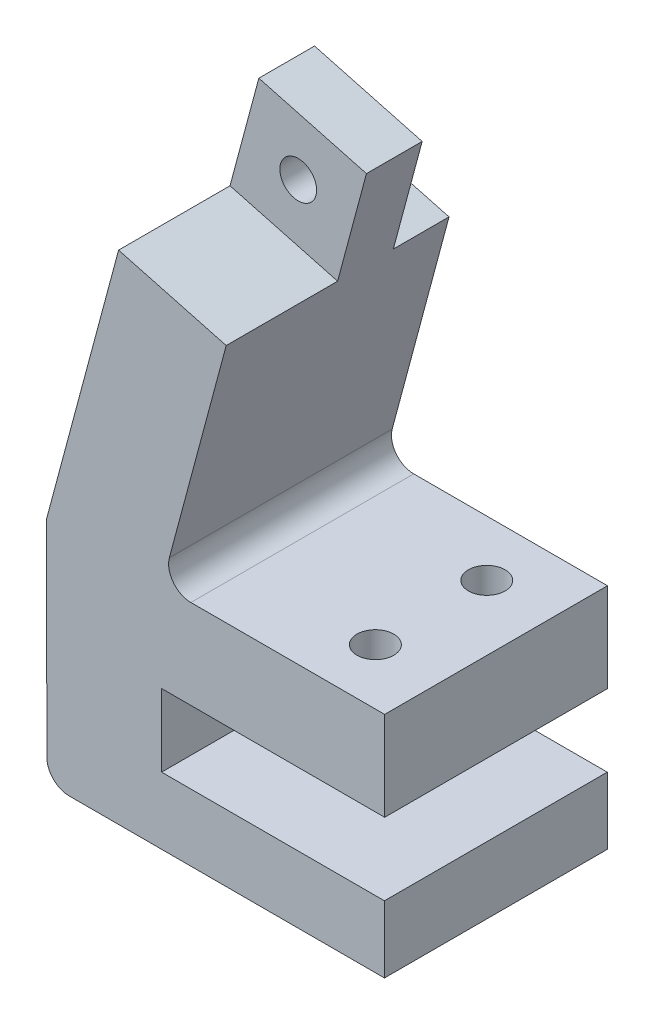
ISO-10303-21;
HEADER;
FILE_DESCRIPTION(('STEP AP214'),'2;1');
FILE_NAME('part.step','',(''),(''),'','','');
FILE_SCHEMA(('AUTOMOTIVE_DESIGN { 1 0 10303 214 1 1 1 1 }'));
ENDSEC;
DATA;
#1=APPLICATION_CONTEXT('core data for automotive mechanical design processes');
#2=APPLICATION_PROTOCOL_DEFINITION('international standard','automotive_design',2000,#1);
#3=PRODUCT_CONTEXT('',#1,'mechanical');
#4=PRODUCT('Part','Part','',(#3));
#5=PRODUCT_RELATED_PRODUCT_CATEGORY('part','',(#4));
#6=PRODUCT_DEFINITION_FORMATION('','',#4);
#7=PRODUCT_DEFINITION_CONTEXT('part definition',#1,'design');
#8=PRODUCT_DEFINITION('design','',#6,#7);
#9=PRODUCT_DEFINITION_SHAPE('','',#8);
#10=(LENGTH_UNIT() NAMED_UNIT(*) SI_UNIT(.MILLI.,.METRE.));
#11=(NAMED_UNIT(*) PLANE_ANGLE_UNIT() SI_UNIT($,.RADIAN.));
#12=(NAMED_UNIT(*) SI_UNIT($,.STERADIAN.) SOLID_ANGLE_UNIT());
#13=UNCERTAINTY_MEASURE_WITH_UNIT(LENGTH_MEASURE(1.E-05),#10,'distance_accuracy_value','');
#14=(GEOMETRIC_REPRESENTATION_CONTEXT(3) GLOBAL_UNCERTAINTY_ASSIGNED_CONTEXT((#13)) GLOBAL_UNIT_ASSIGNED_CONTEXT((#10,
#11,#12)) REPRESENTATION_CONTEXT('',''));
#15=CARTESIAN_POINT('',(0.,0.,0.));
#16=DIRECTION('',(0.,0.,1.));
#17=DIRECTION('',(1.,0.,0.));
#18=AXIS2_PLACEMENT_3D('',#15,#16,#17);
#19=CARTESIAN_POINT('',(-5.79861952645607,12.4476329539094,15.));
#20=DIRECTION('',(0.,-1.,0.));
#21=DIRECTION('',(0.,0.,-1.));
#22=AXIS2_PLACEMENT_3D('',#19,#20,#21);
#23=CYLINDRICAL_SURFACE('',#22,1.65);
#24=CARTESIAN_POINT('',(-5.79861952645607,20.4476329539094,15.));
#25=DIRECTION('',(0.,-1.,0.));
#26=DIRECTION('',(1.,0.,0.));
#27=AXIS2_PLACEMENT_3D('',#24,#25,#26);
#28=CIRCLE('',#27,1.65);
#29=CARTESIAN_POINT('',(-4.14861952645607,20.4476329539095,15.));
#30=VERTEX_POINT('',#29);
#31=EDGE_CURVE('E306',#30,#30,#28,.T.);
#32=ORIENTED_EDGE('',*,*,#31,.F.);
#33=EDGE_LOOP('',(#32));
#34=FACE_BOUND('',#33,.T.);
#35=CARTESIAN_POINT('',(-5.79861952645607,16.9476329539094,15.));
#36=DIRECTION('',(0.,-1.,0.));
#37=DIRECTION('',(1.,0.,0.));
#38=AXIS2_PLACEMENT_3D('',#35,#36,#37);
#39=CIRCLE('',#38,1.65);
#40=CARTESIAN_POINT('',(-4.14861952645607,16.9476329539095,15.));
#41=VERTEX_POINT('',#40);
#42=EDGE_CURVE('E43',#41,#41,#39,.F.);
#43=ORIENTED_EDGE('',*,*,#42,.F.);
#44=EDGE_LOOP('',(#43));
#45=FACE_BOUND('',#44,.T.);
#46=ADVANCED_FACE('F39',(#34,#45),#23,.F.);
#47=CARTESIAN_POINT('',(-5.79861952645607,12.4476329539094,5.));
#48=DIRECTION('',(0.,-1.,0.));
#49=DIRECTION('',(0.,0.,-1.));
#50=AXIS2_PLACEMENT_3D('',#47,#48,#49);
#51=CYLINDRICAL_SURFACE('',#50,1.65);
#52=CARTESIAN_POINT('',(-5.79861952645607,20.4476329539094,5.));
#53=DIRECTION('',(0.,-1.,0.));
#54=DIRECTION('',(1.,0.,0.));
#55=AXIS2_PLACEMENT_3D('',#52,#53,#54);
#56=CIRCLE('',#55,1.65);
#57=CARTESIAN_POINT('',(-4.14861952645607,20.4476329539095,5.));
#58=VERTEX_POINT('',#57);
#59=EDGE_CURVE('E302',#58,#58,#56,.T.);
#60=ORIENTED_EDGE('',*,*,#59,.F.);
#61=EDGE_LOOP('',(#60));
#62=FACE_BOUND('',#61,.T.);
#63=CARTESIAN_POINT('',(-5.79861952645607,16.9476329539094,5.));
#64=DIRECTION('',(0.,-1.,0.));
#65=DIRECTION('',(1.,0.,0.));
#66=AXIS2_PLACEMENT_3D('',#63,#64,#65);
#67=CIRCLE('',#66,1.65);
#68=CARTESIAN_POINT('',(-4.14861952645607,16.9476329539095,5.));
#69=VERTEX_POINT('',#68);
#70=EDGE_CURVE('E255',#69,#69,#67,.F.);
#71=ORIENTED_EDGE('',*,*,#70,.F.);
#72=EDGE_LOOP('',(#71));
#73=FACE_BOUND('',#72,.T.);
#74=ADVANCED_FACE('F507',(#62,#73),#51,.F.);
#75=CARTESIAN_POINT('',(-20.0000684269883,12.4476329539093,20.));
#76=DIRECTION('',(0.,1.,0.));
#77=DIRECTION('',(-1.,0.,0.));
#78=AXIS2_PLACEMENT_3D('',#75,#76,#77);
#79=PLANE('',#78);
#80=DIRECTION('',(-1.,0.,0.));
#81=VECTOR('',#80,1.);
#82=CARTESIAN_POINT('',(-7.26575960156819,12.4476329539094,17.9));
#83=LINE('',#82,#81);
#84=CARTESIAN_POINT('',(-4.33147945134395,12.4476329539095,17.9));
#85=VERTEX_POINT('',#84);
#86=CARTESIAN_POINT('',(-7.26575960156819,12.4476329539094,17.9));
#87=VERTEX_POINT('',#86);
#88=EDGE_CURVE('E245',#85,#87,#83,.T.);
#89=ORIENTED_EDGE('',*,*,#88,.F.);
#90=CARTESIAN_POINT('',(-5.79861952645607,12.4476329539094,15.));
#91=DIRECTION('',(0.,-1.,0.));
#92=DIRECTION('',(1.,0.,0.));
#93=AXIS2_PLACEMENT_3D('',#90,#91,#92);
#94=CIRCLE('',#93,3.25);
#95=CARTESIAN_POINT('',(-4.33147945134395,12.4476329539095,12.1));
#96=VERTEX_POINT('',#95);
#97=EDGE_CURVE('E57',#96,#85,#94,.T.);
#98=ORIENTED_EDGE('',*,*,#97,.F.);
#99=DIRECTION('',(1.,0.,0.));
#100=VECTOR('',#99,1.);
#101=CARTESIAN_POINT('',(-7.26575960156819,12.4476329539094,12.1));
#102=LINE('',#101,#100);
#103=CARTESIAN_POINT('',(-7.26575960156819,12.4476329539094,12.1));
#104=VERTEX_POINT('',#103);
#105=EDGE_CURVE('E232',#104,#96,#102,.T.);
#106=ORIENTED_EDGE('',*,*,#105,.F.);
#107=CARTESIAN_POINT('',(-5.79861952645607,12.4476329539094,15.));
#108=DIRECTION('',(0.,-1.,0.));
#109=DIRECTION('',(1.,0.,0.));
#110=AXIS2_PLACEMENT_3D('',#107,#108,#109);
#111=CIRCLE('',#110,3.25);
#112=EDGE_CURVE('E236',#87,#104,#111,.T.);
#113=ORIENTED_EDGE('',*,*,#112,.F.);
#114=EDGE_LOOP('',(#89,#98,#106,#113));
#115=FACE_BOUND('',#114,.T.);
#116=DIRECTION('',(-1.,0.,0.));
#117=VECTOR('',#116,1.);
#118=CARTESIAN_POINT('',(-7.26575960156819,12.4476329539094,7.9));
#119=LINE('',#118,#117);
#120=CARTESIAN_POINT('',(-4.33147945134395,12.4476329539095,7.9));
#121=VERTEX_POINT('',#120);
#122=CARTESIAN_POINT('',(-7.26575960156819,12.4476329539094,7.9));
#123=VERTEX_POINT('',#122);
#124=EDGE_CURVE('E281',#121,#123,#119,.T.);
#125=ORIENTED_EDGE('',*,*,#124,.F.);
#126=CARTESIAN_POINT('',(-5.79861952645607,12.4476329539094,5.));
#127=DIRECTION('',(0.,-1.,0.));
#128=DIRECTION('',(1.,0.,0.));
#129=AXIS2_PLACEMENT_3D('',#126,#127,#128);
#130=CIRCLE('',#129,3.25);
#131=CARTESIAN_POINT('',(-4.33147945134395,12.4476329539095,2.1));
#132=VERTEX_POINT('',#131);
#133=EDGE_CURVE('E65',#132,#121,#130,.T.);
#134=ORIENTED_EDGE('',*,*,#133,.F.);
#135=DIRECTION('',(1.,0.,0.));
#136=VECTOR('',#135,1.);
#137=CARTESIAN_POINT('',(-7.26575960156819,12.4476329539094,2.1));
#138=LINE('',#137,#136);
#139=CARTESIAN_POINT('',(-7.26575960156819,12.4476329539094,2.1));
#140=VERTEX_POINT('',#139);
#141=EDGE_CURVE('E266',#140,#132,#138,.T.);
#142=ORIENTED_EDGE('',*,*,#141,.F.);
#143=CARTESIAN_POINT('',(-5.79861952645607,12.4476329539094,5.));
#144=DIRECTION('',(0.,-1.,0.));
#145=DIRECTION('',(1.,0.,0.));
#146=AXIS2_PLACEMENT_3D('',#143,#144,#145);
#147=CIRCLE('',#146,3.25);
#148=EDGE_CURVE('E285',#123,#140,#147,.T.);
#149=ORIENTED_EDGE('',*,*,#148,.F.);
#150=EDGE_LOOP('',(#125,#134,#142,#149));
#151=FACE_BOUND('',#150,.T.);
#152=DIRECTION('',(1.,0.,0.));
#153=VECTOR('',#152,1.);
#154=CARTESIAN_POINT('',(-20.0000684269883,12.4476329539093,0.));
#155=LINE('',#154,#153);
#156=CARTESIAN_POINT('',(-20.0000684269883,12.4476329539093,0.));
#157=VERTEX_POINT('',#156);
#158=CARTESIAN_POINT('',(0.0375979097115367,12.4476329539095,0.));
#159=VERTEX_POINT('',#158);
#160=EDGE_CURVE('E419',#157,#159,#155,.T.);
#161=ORIENTED_EDGE('',*,*,#160,.T.);
#162=DIRECTION('',(0.,0.,-1.));
#163=VECTOR('',#162,1.);
#164=CARTESIAN_POINT('',(0.0375979097115367,12.4476329539095,20.));
#165=LINE('',#164,#163);
#166=CARTESIAN_POINT('',(0.0375979097115367,12.4476329539095,20.));
#167=VERTEX_POINT('',#166);
#168=EDGE_CURVE('E454',#167,#159,#165,.T.);
#169=ORIENTED_EDGE('',*,*,#168,.F.);
#170=DIRECTION('',(1.,0.,0.));
#171=VECTOR('',#170,1.);
#172=CARTESIAN_POINT('',(-20.0000684269883,12.4476329539093,20.));
#173=LINE('',#172,#171);
#174=CARTESIAN_POINT('',(-20.0000684269883,12.4476329539093,20.));
#175=VERTEX_POINT('',#174);
#176=EDGE_CURVE('E386',#175,#167,#173,.T.);
#177=ORIENTED_EDGE('',*,*,#176,.F.);
#178=DIRECTION('',(0.,0.,-1.));
#179=VECTOR('',#178,1.);
#180=CARTESIAN_POINT('',(-20.0000684269883,12.4476329539093,20.));
#181=LINE('',#180,#179);
#182=EDGE_CURVE('E458',#175,#157,#181,.T.);
#183=ORIENTED_EDGE('',*,*,#182,.T.);
#184=EDGE_LOOP('',(#161,#169,#177,#183));
#185=FACE_BOUND('',#184,.T.);
#186=ADVANCED_FACE('F513',(#115,#151,#185),#79,.F.);
#187=CARTESIAN_POINT('',(-21.2564973158032,54.2550368740267,20.));
#188=DIRECTION('',(-0.258819045102511,-0.965925826289071,0.));
#189=DIRECTION('',(0.965925826289071,-0.258819045102511,0.));
#190=AXIS2_PLACEMENT_3D('',#187,#188,#189);
#191=PLANE('',#190);
#192=DIRECTION('',(0.,0.,-1.));
#193=VECTOR('',#192,1.);
#194=CARTESIAN_POINT('',(-11.597239052912,51.6668464230015,20.));
#195=LINE('',#194,#193);
#196=CARTESIAN_POINT('',(-11.597239052912,51.6668464230015,10.));
#197=VERTEX_POINT('',#196);
#198=CARTESIAN_POINT('',(-11.597239052912,51.6668464230015,5.));
#199=VERTEX_POINT('',#198);
#200=EDGE_CURVE('E446',#197,#199,#195,.T.);
#201=ORIENTED_EDGE('',*,*,#200,.T.);
#202=DIRECTION('',(0.965925826289067,-0.258819045102526,0.));
#203=VECTOR('',#202,1.);
#204=CARTESIAN_POINT('',(-22.2224231420917,54.5138559191292,5.));
#205=LINE('',#204,#203);
#206=CARTESIAN_POINT('',(-21.2564973158032,54.2550368740269,5.));
#207=VERTEX_POINT('',#206);
#208=EDGE_CURVE('E317',#207,#199,#205,.T.);
#209=ORIENTED_EDGE('',*,*,#208,.F.);
#210=DIRECTION('',(0.,0.,-1.));
#211=VECTOR('',#210,1.);
#212=CARTESIAN_POINT('',(-21.2564973158032,54.2550368740267,20.));
#213=LINE('',#212,#211);
#214=CARTESIAN_POINT('',(-21.2564973158032,54.2550368740267,10.));
#215=VERTEX_POINT('',#214);
#216=EDGE_CURVE('E442',#215,#207,#213,.T.);
#217=ORIENTED_EDGE('',*,*,#216,.F.);
#218=DIRECTION('',(-0.965925826289071,0.258819045102511,0.));
#219=VECTOR('',#218,1.);
#220=CARTESIAN_POINT('',(-21.2564973158032,54.2550368740267,10.));
#221=LINE('',#220,#219);
#222=EDGE_CURVE('E360',#197,#215,#221,.T.);
#223=ORIENTED_EDGE('',*,*,#222,.F.);
#224=EDGE_LOOP('',(#201,#209,#217,#223));
#225=FACE_BOUND('',#224,.T.);
#226=ADVANCED_FACE('F566',(#225),#191,.F.);
#227=CARTESIAN_POINT('',(-30.2796638365886,-0.0523661789465783,20.));
#228=DIRECTION('',(0.,1.,0.));
#229=DIRECTION('',(-1.,0.,0.));
#230=AXIS2_PLACEMENT_3D('',#227,#228,#229);
#231=PLANE('',#230);
#232=DIRECTION('',(1.,0.,0.));
#233=VECTOR('',#232,1.);
#234=CARTESIAN_POINT('',(-30.2796638365886,-0.0523661789465783,20.));
#235=LINE('',#234,#233);
#236=CARTESIAN_POINT('',(-28.2831242581905,-0.0523661789465507,20.));
#237=VERTEX_POINT('',#236);
#238=CARTESIAN_POINT('',(0.0201441864600046,-0.0523661789461585,20.));
#239=VERTEX_POINT('',#238);
#240=EDGE_CURVE('E373',#237,#239,#235,.T.);
#241=ORIENTED_EDGE('',*,*,#240,.F.);
#242=DIRECTION('',(0.,0.,-1.));
#243=VECTOR('',#242,1.);
#244=CARTESIAN_POINT('',(-28.2831242581905,-0.0523661789465507,20.));
#245=LINE('',#244,#243);
#246=CARTESIAN_POINT('',(-28.2831242581905,-0.0523661789465507,0.));
#247=VERTEX_POINT('',#246);
#248=EDGE_CURVE('E487',#237,#247,#245,.T.);
#249=ORIENTED_EDGE('',*,*,#248,.T.);
#250=DIRECTION('',(1.,0.,0.));
#251=VECTOR('',#250,1.);
#252=CARTESIAN_POINT('',(-30.2796638365886,-0.0523661789465783,0.));
#253=LINE('',#252,#251);
#254=CARTESIAN_POINT('',(0.0201441864600046,-0.0523661789461585,0.));
#255=VERTEX_POINT('',#254);
#256=EDGE_CURVE('E370',#247,#255,#253,.T.);
#257=ORIENTED_EDGE('',*,*,#256,.T.);
#258=DIRECTION('',(0.,0.,-1.));
#259=VECTOR('',#258,1.);
#260=CARTESIAN_POINT('',(0.0201441864600046,-0.0523661789461585,20.));
#261=LINE('',#260,#259);
#262=EDGE_CURVE('E470',#239,#255,#261,.T.);
#263=ORIENTED_EDGE('',*,*,#262,.F.);
#264=EDGE_LOOP('',(#241,#249,#257,#263));
#265=FACE_BOUND('',#264,.T.);
#266=ADVANCED_FACE('F569',(#265),#231,.F.);
#267=CARTESIAN_POINT('',(0.0201441864600046,-0.0523661789461585,20.));
#268=DIRECTION('',(-0.999999855475947,-0.000537631923378172,0.));
#269=DIRECTION('',(0.000537631923378172,-0.999999855475947,0.));
#270=AXIS2_PLACEMENT_3D('',#267,#268,#269);
#271=PLANE('',#270);
#272=DIRECTION('',(-0.000537631923378172,0.999999855475947,0.));
#273=VECTOR('',#272,1.);
#274=CARTESIAN_POINT('',(0.0201441864600046,-0.0523661789461585,0.));
#275=LINE('',#274,#273);
#276=CARTESIAN_POINT('',(0.0169183949197356,5.94763295390952,0.));
#277=VERTEX_POINT('',#276);
#278=EDGE_CURVE('E410',#255,#277,#275,.T.);
#279=ORIENTED_EDGE('',*,*,#278,.T.);
#280=DIRECTION('',(0.,0.,-1.));
#281=VECTOR('',#280,1.);
#282=CARTESIAN_POINT('',(0.0169183949197356,5.94763295390952,20.));
#283=LINE('',#282,#281);
#284=CARTESIAN_POINT('',(0.0169183949197356,5.94763295390952,20.));
#285=VERTEX_POINT('',#284);
#286=EDGE_CURVE('E466',#285,#277,#283,.T.);
#287=ORIENTED_EDGE('',*,*,#286,.F.);
#288=DIRECTION('',(-0.000537631923378172,0.999999855475947,0.));
#289=VECTOR('',#288,1.);
#290=CARTESIAN_POINT('',(0.0201441864600046,-0.0523661789461585,20.));
#291=LINE('',#290,#289);
#292=EDGE_CURVE('E376',#239,#285,#291,.T.);
#293=ORIENTED_EDGE('',*,*,#292,.F.);
#294=ORIENTED_EDGE('',*,*,#262,.T.);
#295=EDGE_LOOP('',(#279,#287,#293,#294));
#296=FACE_BOUND('',#295,.T.);
#297=ADVANCED_FACE('F592',(#296),#271,.F.);
#298=CARTESIAN_POINT('',(0.0169183949197356,5.94763295390952,20.));
#299=DIRECTION('',(0.,-1.,0.));
#300=DIRECTION('',(1.,0.,0.));
#301=AXIS2_PLACEMENT_3D('',#298,#299,#300);
#302=PLANE('',#301);
#303=DIRECTION('',(-1.,0.,0.));
#304=VECTOR('',#303,1.);
#305=CARTESIAN_POINT('',(0.0169183949197356,5.94763295390952,0.));
#306=LINE('',#305,#304);
#307=CARTESIAN_POINT('',(-19.9830816050803,5.94763295390925,0.));
#308=VERTEX_POINT('',#307);
#309=EDGE_CURVE('E413',#277,#308,#306,.T.);
#310=ORIENTED_EDGE('',*,*,#309,.T.);
#311=DIRECTION('',(0.,0.,-1.));
#312=VECTOR('',#311,1.);
#313=CARTESIAN_POINT('',(-19.9830816050803,5.94763295390925,20.));
#314=LINE('',#313,#312);
#315=CARTESIAN_POINT('',(-19.9830816050803,5.94763295390925,20.));
#316=VERTEX_POINT('',#315);
#317=EDGE_CURVE('E462',#316,#308,#314,.T.);
#318=ORIENTED_EDGE('',*,*,#317,.F.);
#319=DIRECTION('',(-1.,0.,0.));
#320=VECTOR('',#319,1.);
#321=CARTESIAN_POINT('',(0.0169183949197356,5.94763295390952,20.));
#322=LINE('',#321,#320);
#323=EDGE_CURVE('E380',#285,#316,#322,.T.);
#324=ORIENTED_EDGE('',*,*,#323,.F.);
#325=ORIENTED_EDGE('',*,*,#286,.T.);
#326=EDGE_LOOP('',(#310,#318,#324,#325));
#327=FACE_BOUND('',#326,.T.);
#328=ADVANCED_FACE('F588',(#327),#302,.F.);
#329=CARTESIAN_POINT('',(-19.9830816050803,5.94763295390925,20.));
#330=DIRECTION('',(-0.999996585199521,-0.00261334829253206,0.));
#331=DIRECTION('',(0.00261334829253206,-0.999996585199521,0.));
#332=AXIS2_PLACEMENT_3D('',#329,#330,#331);
#333=PLANE('',#332);
#334=DIRECTION('',(-0.00261334829253206,0.99999658519952,0.));
#335=VECTOR('',#334,1.);
#336=CARTESIAN_POINT('',(-19.9830816050803,5.94763295390925,0.));
#337=LINE('',#336,#335);
#338=EDGE_CURVE('E416',#308,#157,#337,.T.);
#339=ORIENTED_EDGE('',*,*,#338,.T.);
#340=ORIENTED_EDGE('',*,*,#182,.F.);
#341=DIRECTION('',(-0.00261334829253206,0.99999658519952,0.));
#342=VECTOR('',#341,1.);
#343=CARTESIAN_POINT('',(-19.9830816050803,5.94763295390925,20.));
#344=LINE('',#343,#342);
#345=EDGE_CURVE('E383',#316,#175,#344,.T.);
#346=ORIENTED_EDGE('',*,*,#345,.F.);
#347=ORIENTED_EDGE('',*,*,#317,.T.);
#348=EDGE_LOOP('',(#339,#340,#346,#347));
#349=FACE_BOUND('',#348,.T.);
#350=ADVANCED_FACE('F581',(#349),#333,.F.);
#351=CARTESIAN_POINT('',(0.0375979097115367,12.4476329539095,20.));
#352=DIRECTION('',(-1.,-1.6190695973587E-13,0.));
#353=DIRECTION('',(1.6190695973587E-13,-1.,0.));
#354=AXIS2_PLACEMENT_3D('',#351,#352,#353);
#355=PLANE('',#354);
#356=DIRECTION('',(-1.6190695973587E-13,1.,0.));
#357=VECTOR('',#356,1.);
#358=CARTESIAN_POINT('',(0.0375979097115367,12.4476329539095,0.));
#359=LINE('',#358,#357);
#360=CARTESIAN_POINT('',(0.0375979097102415,20.4476329539095,0.));
#361=VERTEX_POINT('',#360);
#362=EDGE_CURVE('E422',#159,#361,#359,.T.);
#363=ORIENTED_EDGE('',*,*,#362,.T.);
#364=DIRECTION('',(0.,0.,-1.));
#365=VECTOR('',#364,1.);
#366=CARTESIAN_POINT('',(0.0375979097102415,20.4476329539095,20.));
#367=LINE('',#366,#365);
#368=CARTESIAN_POINT('',(0.0375979097102415,20.4476329539095,20.));
#369=VERTEX_POINT('',#368);
#370=EDGE_CURVE('E450',#369,#361,#367,.T.);
#371=ORIENTED_EDGE('',*,*,#370,.F.);
#372=DIRECTION('',(-1.6190695973587E-13,1.,0.));
#373=VECTOR('',#372,1.);
#374=CARTESIAN_POINT('',(0.0375979097115367,12.4476329539095,20.));
#375=LINE('',#374,#373);
#376=EDGE_CURVE('E389',#167,#369,#375,.T.);
#377=ORIENTED_EDGE('',*,*,#376,.F.);
#378=ORIENTED_EDGE('',*,*,#168,.T.);
#379=EDGE_LOOP('',(#363,#371,#377,#378));
#380=FACE_BOUND('',#379,.T.);
#381=ADVANCED_FACE('F577',(#380),#355,.F.);
#382=CARTESIAN_POINT('',(0.0375979097102415,20.4476329539095,20.));
#383=DIRECTION('',(0.,-1.,0.));
#384=DIRECTION('',(1.,0.,0.));
#385=AXIS2_PLACEMENT_3D('',#382,#383,#384);
#386=PLANE('',#385);
#387=ORIENTED_EDGE('',*,*,#59,.T.);
#388=EDGE_LOOP('',(#387));
#389=FACE_BOUND('',#388,.T.);
#390=ORIENTED_EDGE('',*,*,#31,.T.);
#391=EDGE_LOOP('',(#390));
#392=FACE_BOUND('',#391,.T.);
#393=DIRECTION('',(-1.,0.,0.));
#394=VECTOR('',#393,1.);
#395=CARTESIAN_POINT('',(0.0375979097102415,20.4476329539095,0.));
#396=LINE('',#395,#394);
#397=CARTESIAN_POINT('',(-17.3559513446078,20.4476329539093,0.));
#398=VERTEX_POINT('',#397);
#399=EDGE_CURVE('E425',#361,#398,#396,.T.);
#400=ORIENTED_EDGE('',*,*,#399,.T.);
#401=DIRECTION('',(0.,0.,-1.));
#402=VECTOR('',#401,1.);
#403=CARTESIAN_POINT('',(-17.3559513446078,20.4476329539093,20.));
#404=LINE('',#403,#402);
#405=CARTESIAN_POINT('',(-17.3559513446078,20.4476329539093,20.));
#406=VERTEX_POINT('',#405);
#407=EDGE_CURVE('E478',#398,#406,#404,.F.);
#408=ORIENTED_EDGE('',*,*,#407,.T.);
#409=DIRECTION('',(-1.,0.,0.));
#410=VECTOR('',#409,1.);
#411=CARTESIAN_POINT('',(0.0375979097102415,20.4476329539095,20.));
#412=LINE('',#411,#410);
#413=EDGE_CURVE('E392',#369,#406,#412,.T.);
#414=ORIENTED_EDGE('',*,*,#413,.F.);
#415=ORIENTED_EDGE('',*,*,#370,.T.);
#416=EDGE_LOOP('',(#400,#408,#414,#415));
#417=FACE_BOUND('',#416,.T.);
#418=ADVANCED_FACE('F573',(#389,#392,#417),#386,.F.);
#419=CARTESIAN_POINT('',(-19.9624020902902,20.4476329539093,20.));
#420=DIRECTION('',(-0.965925826289067,0.258819045102526,0.));
#421=DIRECTION('',(-0.258819045102526,-0.965925826289067,0.));
#422=AXIS2_PLACEMENT_3D('',#419,#420,#421);
#423=PLANE('',#422);
#424=DIRECTION('',(0.258819045102526,0.965925826289067,0.));
#425=VECTOR('',#424,1.);
#426=CARTESIAN_POINT('',(-19.9624020902902,20.4476329539093,0.));
#427=LINE('',#426,#425);
#428=CARTESIAN_POINT('',(-19.2878029971859,22.9652710441143,0.));
#429=VERTEX_POINT('',#428);
#430=CARTESIAN_POINT('',(-14.1854295039372,42.0075881601108,0.));
#431=VERTEX_POINT('',#430);
#432=EDGE_CURVE('E429',#429,#431,#427,.T.);
#433=ORIENTED_EDGE('',*,*,#432,.T.);
#434=DIRECTION('',(0.,0.,-1.));
#435=VECTOR('',#434,1.);
#436=CARTESIAN_POINT('',(-14.1854295039372,42.0075881601108,0.));
#437=LINE('',#436,#435);
#438=CARTESIAN_POINT('',(-14.1854295039372,42.0075881601108,5.));
#439=VERTEX_POINT('',#438);
#440=EDGE_CURVE('E314',#439,#431,#437,.T.);
#441=ORIENTED_EDGE('',*,*,#440,.F.);
#442=DIRECTION('',(-0.258819045102526,-0.965925826289067,0.));
#443=VECTOR('',#442,1.);
#444=CARTESIAN_POINT('',(-11.597239052912,51.6668464230015,5.));
#445=LINE('',#444,#443);
#446=EDGE_CURVE('E310',#199,#439,#445,.T.);
#447=ORIENTED_EDGE('',*,*,#446,.F.);
#448=ORIENTED_EDGE('',*,*,#200,.F.);
#449=DIRECTION('',(0.258819045102511,0.965925826289071,0.));
#450=VECTOR('',#449,1.);
#451=CARTESIAN_POINT('',(-11.597239052912,51.6668464230015,10.));
#452=LINE('',#451,#450);
#453=CARTESIAN_POINT('',(-14.1854295039371,42.0075881601108,10.));
#454=VERTEX_POINT('',#453);
#455=EDGE_CURVE('E357',#454,#197,#452,.T.);
#456=ORIENTED_EDGE('',*,*,#455,.F.);
#457=DIRECTION('',(0.,0.,1.));
#458=VECTOR('',#457,1.);
#459=CARTESIAN_POINT('',(-14.1854295039371,42.0075881601108,10.));
#460=LINE('',#459,#458);
#461=CARTESIAN_POINT('',(-14.1854295039371,42.0075881601108,20.));
#462=VERTEX_POINT('',#461);
#463=EDGE_CURVE('E366',#454,#462,#460,.T.);
#464=ORIENTED_EDGE('',*,*,#463,.T.);
#465=DIRECTION('',(0.258819045102526,0.965925826289067,0.));
#466=VECTOR('',#465,1.);
#467=CARTESIAN_POINT('',(-19.9624020902902,20.4476329539093,20.));
#468=LINE('',#467,#466);
#469=CARTESIAN_POINT('',(-19.2878029971859,22.9652710441143,20.));
#470=VERTEX_POINT('',#469);
#471=EDGE_CURVE('E396',#470,#462,#468,.T.);
#472=ORIENTED_EDGE('',*,*,#471,.F.);
#473=DIRECTION('',(0.,0.,-1.));
#474=VECTOR('',#473,1.);
#475=CARTESIAN_POINT('',(-19.2878029971859,22.9652710441143,0.));
#476=LINE('',#475,#474);
#477=EDGE_CURVE('E474',#470,#429,#476,.T.);
#478=ORIENTED_EDGE('',*,*,#477,.T.);
#479=EDGE_LOOP('',(#433,#441,#447,#448,#456,#464,#472,#478));
#480=FACE_BOUND('',#479,.T.);
#481=ADVANCED_FACE('F564',(#480),#423,.F.);
#482=CARTESIAN_POINT('',(-21.2564973158032,54.2550368740267,20.));
#483=DIRECTION('',(0.965925826289071,-0.258819045102512,0.));
#484=DIRECTION('',(0.258819045102512,0.965925826289071,0.));
#485=AXIS2_PLACEMENT_3D('',#482,#483,#484);
#486=PLANE('',#485);
#487=DIRECTION('',(-0.258819045102512,-0.965925826289071,0.));
#488=VECTOR('',#487,1.);
#489=CARTESIAN_POINT('',(-21.2564973158032,54.2550368740267,5.));
#490=LINE('',#489,#488);
#491=CARTESIAN_POINT('',(-23.8446877668283,44.5957786111362,5.));
#492=VERTEX_POINT('',#491);
#493=EDGE_CURVE('E328',#207,#492,#490,.T.);
#494=ORIENTED_EDGE('',*,*,#493,.T.);
#495=DIRECTION('',(0.,0.,-1.));
#496=VECTOR('',#495,1.);
#497=CARTESIAN_POINT('',(-23.8446877668283,44.5957786111362,20.));
#498=LINE('',#497,#496);
#499=CARTESIAN_POINT('',(-23.8446877668283,44.5957786111362,0.));
#500=VERTEX_POINT('',#499);
#501=EDGE_CURVE('E332',#492,#500,#498,.T.);
#502=ORIENTED_EDGE('',*,*,#501,.T.);
#503=DIRECTION('',(-0.258819045102512,-0.965925826289071,0.));
#504=VECTOR('',#503,1.);
#505=CARTESIAN_POINT('',(-21.2564973158032,54.2550368740267,0.));
#506=LINE('',#505,#504);
#507=CARTESIAN_POINT('',(-30.3151638943911,20.4476329539092,0.));
#508=VERTEX_POINT('',#507);
#509=EDGE_CURVE('E433',#500,#508,#506,.T.);
#510=ORIENTED_EDGE('',*,*,#509,.T.);
#511=DIRECTION('',(0.,0.,-1.));
#512=VECTOR('',#511,1.);
#513=CARTESIAN_POINT('',(-30.3151638943911,20.4476329539092,20.));
#514=LINE('',#513,#512);
#515=CARTESIAN_POINT('',(-30.3151638943911,20.4476329539092,20.));
#516=VERTEX_POINT('',#515);
#517=EDGE_CURVE('E407',#516,#508,#514,.T.);
#518=ORIENTED_EDGE('',*,*,#517,.F.);
#519=DIRECTION('',(-0.258819045102512,-0.965925826289071,0.));
#520=VECTOR('',#519,1.);
#521=CARTESIAN_POINT('',(-21.2564973158032,54.2550368740267,20.));
#522=LINE('',#521,#520);
#523=CARTESIAN_POINT('',(-23.8446877668283,44.595778611136,20.));
#524=VERTEX_POINT('',#523);
#525=EDGE_CURVE('E400',#524,#516,#522,.T.);
#526=ORIENTED_EDGE('',*,*,#525,.F.);
#527=DIRECTION('',(0.,0.,1.));
#528=VECTOR('',#527,1.);
#529=CARTESIAN_POINT('',(-23.8446877668283,44.595778611136,10.));
#530=LINE('',#529,#528);
#531=CARTESIAN_POINT('',(-23.8446877668283,44.595778611136,10.));
#532=VERTEX_POINT('',#531);
#533=EDGE_CURVE('E363',#532,#524,#530,.T.);
#534=ORIENTED_EDGE('',*,*,#533,.F.);
#535=DIRECTION('',(-0.258819045102511,-0.965925826289071,0.));
#536=VECTOR('',#535,1.);
#537=CARTESIAN_POINT('',(-21.2564973158032,54.2550368740267,10.));
#538=LINE('',#537,#536);
#539=EDGE_CURVE('E349',#215,#532,#538,.T.);
#540=ORIENTED_EDGE('',*,*,#539,.F.);
#541=ORIENTED_EDGE('',*,*,#216,.T.);
#542=EDGE_LOOP('',(#494,#502,#510,#518,#526,#534,#540,#541));
#543=FACE_BOUND('',#542,.T.);
#544=ADVANCED_FACE('F560',(#543),#486,.F.);
#545=CARTESIAN_POINT('',(-30.3151638943911,20.4476329539092,20.));
#546=DIRECTION('',(0.999998500593247,0.00173170761342305,0.));
#547=DIRECTION('',(-0.00173170761342305,0.999998500593247,0.));
#548=AXIS2_PLACEMENT_3D('',#545,#546,#547);
#549=PLANE('',#548);
#550=DIRECTION('',(0.00173170761342305,-0.999998500593247,0.));
#551=VECTOR('',#550,1.);
#552=CARTESIAN_POINT('',(-30.3151638943911,20.4476329539092,0.));
#553=LINE('',#552,#551);
#554=CARTESIAN_POINT('',(-30.283121259377,1.9441704058266,0.));
#555=VERTEX_POINT('',#554);
#556=EDGE_CURVE('E377',#508,#555,#553,.T.);
#557=ORIENTED_EDGE('',*,*,#556,.T.);
#558=DIRECTION('',(0.,0.,-1.));
#559=VECTOR('',#558,1.);
#560=CARTESIAN_POINT('',(-30.283121259377,1.9441704058266,20.));
#561=LINE('',#560,#559);
#562=CARTESIAN_POINT('',(-30.283121259377,1.9441704058266,20.));
#563=VERTEX_POINT('',#562);
#564=EDGE_CURVE('E49',#555,#563,#561,.F.);
#565=ORIENTED_EDGE('',*,*,#564,.T.);
#566=DIRECTION('',(0.00173170761342305,-0.999998500593247,0.));
#567=VECTOR('',#566,1.);
#568=CARTESIAN_POINT('',(-30.3151638943911,20.4476329539092,20.));
#569=LINE('',#568,#567);
#570=EDGE_CURVE('E403',#516,#563,#569,.T.);
#571=ORIENTED_EDGE('',*,*,#570,.F.);
#572=ORIENTED_EDGE('',*,*,#517,.T.);
#573=EDGE_LOOP('',(#557,#565,#571,#572));
#574=FACE_BOUND('',#573,.T.);
#575=ADVANCED_FACE('F552',(#574),#549,.F.);
#576=CARTESIAN_POINT('',(0.,0.,20.));
#577=DIRECTION('',(0.,0.,1.));
#578=DIRECTION('',(1.,0.,0.));
#579=AXIS2_PLACEMENT_3D('',#576,#577,#578);
#580=PLANE('',#579);
#581=DIRECTION('',(0.965925826289071,-0.258819045102511,0.));
#582=VECTOR('',#581,1.);
#583=CARTESIAN_POINT('',(-23.8446877668283,44.595778611136,20.));
#584=LINE('',#583,#582);
#585=EDGE_CURVE('E348',#524,#462,#584,.T.);
#586=ORIENTED_EDGE('',*,*,#585,.F.);
#587=ORIENTED_EDGE('',*,*,#525,.T.);
#588=ORIENTED_EDGE('',*,*,#570,.T.);
#589=CARTESIAN_POINT('',(-28.2831242581905,1.94763382105345,20.));
#590=DIRECTION('',(0.,0.,1.));
#591=DIRECTION('',(1.,0.,0.));
#592=AXIS2_PLACEMENT_3D('',#589,#590,#591);
#593=CIRCLE('',#592,2.);
#594=EDGE_CURVE('E11',#563,#237,#593,.T.);
#595=ORIENTED_EDGE('',*,*,#594,.T.);
#596=ORIENTED_EDGE('',*,*,#240,.T.);
#597=ORIENTED_EDGE('',*,*,#292,.T.);
#598=ORIENTED_EDGE('',*,*,#323,.T.);
#599=ORIENTED_EDGE('',*,*,#345,.T.);
#600=ORIENTED_EDGE('',*,*,#176,.T.);
#601=ORIENTED_EDGE('',*,*,#376,.T.);
#602=ORIENTED_EDGE('',*,*,#413,.T.);
#603=CARTESIAN_POINT('',(-17.3559513446078,22.4476329539093,20.));
#604=DIRECTION('',(0.,0.,1.));
#605=DIRECTION('',(1.,0.,0.));
#606=AXIS2_PLACEMENT_3D('',#603,#604,#605);
#607=CIRCLE('',#606,2.);
#608=EDGE_CURVE('E484',#406,#470,#607,.F.);
#609=ORIENTED_EDGE('',*,*,#608,.T.);
#610=ORIENTED_EDGE('',*,*,#471,.T.);
#611=EDGE_LOOP('',(#586,#587,#588,#595,#596,#597,#598,#599,#600,#601,#602,#609,#610));
#612=FACE_BOUND('',#611,.T.);
#613=ADVANCED_FACE('F548',(#612),#580,.T.);
#614=CARTESIAN_POINT('',(0.,0.,0.));
#615=DIRECTION('',(0.,0.,1.));
#616=DIRECTION('',(1.,0.,0.));
#617=AXIS2_PLACEMENT_3D('',#614,#615,#616);
#618=PLANE('',#617);
#619=ORIENTED_EDGE('',*,*,#509,.F.);
#620=DIRECTION('',(0.965925826289067,-0.258819045102526,0.));
#621=VECTOR('',#620,1.);
#622=CARTESIAN_POINT('',(-24.810613593117,44.8545976562386,0.));
#623=LINE('',#622,#621);
#624=EDGE_CURVE('E318',#500,#431,#623,.T.);
#625=ORIENTED_EDGE('',*,*,#624,.T.);
#626=ORIENTED_EDGE('',*,*,#432,.F.);
#627=CARTESIAN_POINT('',(-17.3559513446078,22.4476329539093,0.));
#628=DIRECTION('',(0.,0.,1.));
#629=DIRECTION('',(1.,0.,0.));
#630=AXIS2_PLACEMENT_3D('',#627,#628,#629);
#631=CIRCLE('',#630,2.);
#632=EDGE_CURVE('E481',#429,#398,#631,.T.);
#633=ORIENTED_EDGE('',*,*,#632,.T.);
#634=ORIENTED_EDGE('',*,*,#399,.F.);
#635=ORIENTED_EDGE('',*,*,#362,.F.);
#636=ORIENTED_EDGE('',*,*,#160,.F.);
#637=ORIENTED_EDGE('',*,*,#338,.F.);
#638=ORIENTED_EDGE('',*,*,#309,.F.);
#639=ORIENTED_EDGE('',*,*,#278,.F.);
#640=ORIENTED_EDGE('',*,*,#256,.F.);
#641=CARTESIAN_POINT('',(-28.2831242581905,1.94763382105345,0.));
#642=DIRECTION('',(0.,0.,1.));
#643=DIRECTION('',(1.,0.,0.));
#644=AXIS2_PLACEMENT_3D('',#641,#642,#643);
#645=CIRCLE('',#644,2.);
#646=EDGE_CURVE('E491',#247,#555,#645,.F.);
#647=ORIENTED_EDGE('',*,*,#646,.T.);
#648=ORIENTED_EDGE('',*,*,#556,.F.);
#649=EDGE_LOOP('',(#619,#625,#626,#633,#634,#635,#636,#637,#638,#639,#640,#647,#648));
#650=FACE_BOUND('',#649,.T.);
#651=ADVANCED_FACE('F551',(#650),#618,.F.);
#652=CARTESIAN_POINT('',(-17.3559513446078,22.4476329539093,20.));
#653=DIRECTION('',(0.,0.,1.));
#654=DIRECTION('',(1.,0.,0.));
#655=AXIS2_PLACEMENT_3D('',#652,#653,#654);
#656=CYLINDRICAL_SURFACE('',#655,2.);
#657=ORIENTED_EDGE('',*,*,#608,.F.);
#658=ORIENTED_EDGE('',*,*,#407,.F.);
#659=ORIENTED_EDGE('',*,*,#632,.F.);
#660=ORIENTED_EDGE('',*,*,#477,.F.);
#661=EDGE_LOOP('',(#657,#658,#659,#660));
#662=FACE_BOUND('',#661,.T.);
#663=ADVANCED_FACE('F556',(#662),#656,.F.);
#664=CARTESIAN_POINT('',(-28.2831242581905,1.94763382105345,20.));
#665=DIRECTION('',(0.,0.,-1.));
#666=DIRECTION('',(-1.,0.,0.));
#667=AXIS2_PLACEMENT_3D('',#664,#665,#666);
#668=CYLINDRICAL_SURFACE('',#667,2.);
#669=ORIENTED_EDGE('',*,*,#594,.F.);
#670=ORIENTED_EDGE('',*,*,#564,.F.);
#671=ORIENTED_EDGE('',*,*,#646,.F.);
#672=ORIENTED_EDGE('',*,*,#248,.F.);
#673=EDGE_LOOP('',(#669,#670,#671,#672));
#674=FACE_BOUND('',#673,.T.);
#675=ADVANCED_FACE('F41',(#674),#668,.T.);
#676=CARTESIAN_POINT('',(-23.8446877668283,44.595778611136,10.));
#677=DIRECTION('',(-0.258819045102511,-0.965925826289071,0.));
#678=DIRECTION('',(0.965925826289071,-0.258819045102511,0.));
#679=AXIS2_PLACEMENT_3D('',#676,#677,#678);
#680=PLANE('',#679);
#681=ORIENTED_EDGE('',*,*,#585,.T.);
#682=ORIENTED_EDGE('',*,*,#463,.F.);
#683=DIRECTION('',(0.965925826289071,-0.258819045102511,0.));
#684=VECTOR('',#683,1.);
#685=CARTESIAN_POINT('',(-23.8446877668283,44.595778611136,10.));
#686=LINE('',#685,#684);
#687=EDGE_CURVE('E353',#532,#454,#686,.T.);
#688=ORIENTED_EDGE('',*,*,#687,.F.);
#689=ORIENTED_EDGE('',*,*,#533,.T.);
#690=EDGE_LOOP('',(#681,#682,#688,#689));
#691=FACE_BOUND('',#690,.T.);
#692=ADVANCED_FACE('F543',(#691),#680,.F.);
#693=CARTESIAN_POINT('',(0.,0.,10.));
#694=DIRECTION('',(0.,0.,1.));
#695=DIRECTION('',(1.,0.,0.));
#696=AXIS2_PLACEMENT_3D('',#693,#694,#695);
#697=PLANE('',#696);
#698=CARTESIAN_POINT('',(-17.7209634098702,48.1313125170687,10.));
#699=DIRECTION('',(0.,0.,1.));
#700=DIRECTION('',(1.,0.,0.));
#701=AXIS2_PLACEMENT_3D('',#698,#699,#700);
#702=CIRCLE('',#701,1.64999999999999);
#703=CARTESIAN_POINT('',(-16.0709634098702,48.1313125170687,10.));
#704=VERTEX_POINT('',#703);
#705=EDGE_CURVE('E340',#704,#704,#702,.T.);
#706=ORIENTED_EDGE('',*,*,#705,.F.);
#707=EDGE_LOOP('',(#706));
#708=FACE_BOUND('',#707,.T.);
#709=ORIENTED_EDGE('',*,*,#539,.T.);
#710=ORIENTED_EDGE('',*,*,#687,.T.);
#711=ORIENTED_EDGE('',*,*,#455,.T.);
#712=ORIENTED_EDGE('',*,*,#222,.T.);
#713=EDGE_LOOP('',(#709,#710,#711,#712));
#714=FACE_BOUND('',#713,.T.);
#715=ADVANCED_FACE('F539',(#708,#714),#697,.T.);
#716=CARTESIAN_POINT('',(-17.7209634098702,48.1313125170687,6.));
#717=DIRECTION('',(0.,0.,-1.));
#718=DIRECTION('',(-1.,0.,0.));
#719=AXIS2_PLACEMENT_3D('',#716,#717,#718);
#720=CYLINDRICAL_SURFACE('',#719,3.25);
#721=CARTESIAN_POINT('',(-17.7209634098702,48.1313125170687,5.));
#722=DIRECTION('',(0.,0.,1.));
#723=DIRECTION('',(0.,-1.,0.));
#724=AXIS2_PLACEMENT_3D('',#721,#722,#723);
#725=CIRCLE('',#724,3.25);
#726=CARTESIAN_POINT('',(-17.7209634098702,44.8813125170687,5.));
#727=VERTEX_POINT('',#726);
#728=EDGE_CURVE('E322',#727,#727,#725,.F.);
#729=ORIENTED_EDGE('',*,*,#728,.T.);
#730=EDGE_LOOP('',(#729));
#731=FACE_BOUND('',#730,.T.);
#732=CARTESIAN_POINT('',(-17.7209634098702,48.1313125170687,6.));
#733=DIRECTION('',(0.,0.,-1.));
#734=DIRECTION('',(-1.,0.,0.));
#735=AXIS2_PLACEMENT_3D('',#732,#733,#734);
#736=CIRCLE('',#735,3.25);
#737=CARTESIAN_POINT('',(-20.9709634098702,48.1313125170687,6.));
#738=VERTEX_POINT('',#737);
#739=EDGE_CURVE('E344',#738,#738,#736,.T.);
#740=ORIENTED_EDGE('',*,*,#739,.F.);
#741=EDGE_LOOP('',(#740));
#742=FACE_BOUND('',#741,.T.);
#743=ADVANCED_FACE('F535',(#731,#742),#720,.F.);
#744=CARTESIAN_POINT('',(-17.7209634098702,48.1313125170687,6.));
#745=DIRECTION('',(0.,0.,-1.));
#746=DIRECTION('',(-1.,0.,0.));
#747=AXIS2_PLACEMENT_3D('',#744,#745,#746);
#748=PLANE('',#747);
#749=CARTESIAN_POINT('',(-17.7209634098702,48.1313125170687,6.));
#750=DIRECTION('',(0.,0.,-1.));
#751=DIRECTION('',(-1.,0.,0.));
#752=AXIS2_PLACEMENT_3D('',#749,#750,#751);
#753=CIRCLE('',#752,1.64999999999999);
#754=CARTESIAN_POINT('',(-19.3709634098701,48.1313125170687,6.));
#755=VERTEX_POINT('',#754);
#756=EDGE_CURVE('E336',#755,#755,#753,.T.);
#757=ORIENTED_EDGE('',*,*,#756,.F.);
#758=EDGE_LOOP('',(#757));
#759=FACE_BOUND('',#758,.T.);
#760=ORIENTED_EDGE('',*,*,#739,.T.);
#761=EDGE_LOOP('',(#760));
#762=FACE_BOUND('',#761,.T.);
#763=ADVANCED_FACE('F531',(#759,#762),#748,.T.);
#764=CARTESIAN_POINT('',(-17.7209634098702,48.1313125170687,6.));
#765=DIRECTION('',(0.,0.,-1.));
#766=DIRECTION('',(-1.,0.,0.));
#767=AXIS2_PLACEMENT_3D('',#764,#765,#766);
#768=CYLINDRICAL_SURFACE('',#767,1.64999999999999);
#769=ORIENTED_EDGE('',*,*,#756,.T.);
#770=EDGE_LOOP('',(#769));
#771=FACE_BOUND('',#770,.T.);
#772=ORIENTED_EDGE('',*,*,#705,.T.);
#773=EDGE_LOOP('',(#772));
#774=FACE_BOUND('',#773,.T.);
#775=ADVANCED_FACE('F523',(#771,#774),#768,.F.);
#776=CARTESIAN_POINT('',(-24.810613593117,44.8545976562386,0.));
#777=DIRECTION('',(-0.258819045102526,-0.965925826289067,0.));
#778=DIRECTION('',(0.965925826289067,-0.258819045102526,0.));
#779=AXIS2_PLACEMENT_3D('',#776,#777,#778);
#780=PLANE('',#779);
#781=DIRECTION('',(0.965925826289067,-0.258819045102526,0.));
#782=VECTOR('',#781,1.);
#783=CARTESIAN_POINT('',(-24.810613593117,44.8545976562386,5.));
#784=LINE('',#783,#782);
#785=EDGE_CURVE('E323',#492,#439,#784,.T.);
#786=ORIENTED_EDGE('',*,*,#785,.T.);
#787=ORIENTED_EDGE('',*,*,#440,.T.);
#788=ORIENTED_EDGE('',*,*,#624,.F.);
#789=ORIENTED_EDGE('',*,*,#501,.F.);
#790=EDGE_LOOP('',(#786,#787,#788,#789));
#791=FACE_BOUND('',#790,.T.);
#792=ADVANCED_FACE('F519',(#791),#780,.F.);
#793=CARTESIAN_POINT('',(-22.2224231420917,54.5138559191292,5.));
#794=DIRECTION('',(0.,0.,1.));
#795=DIRECTION('',(0.,-1.,0.));
#796=AXIS2_PLACEMENT_3D('',#793,#794,#795);
#797=PLANE('',#796);
#798=ORIENTED_EDGE('',*,*,#728,.F.);
#799=EDGE_LOOP('',(#798));
#800=FACE_BOUND('',#799,.T.);
#801=ORIENTED_EDGE('',*,*,#208,.T.);
#802=ORIENTED_EDGE('',*,*,#446,.T.);
#803=ORIENTED_EDGE('',*,*,#785,.F.);
#804=ORIENTED_EDGE('',*,*,#493,.F.);
#805=EDGE_LOOP('',(#801,#802,#803,#804));
#806=FACE_BOUND('',#805,.T.);
#807=ADVANCED_FACE('F522',(#800,#806),#797,.F.);
#808=CARTESIAN_POINT('',(-5.79861952645613,16.9476329539094,5.));
#809=DIRECTION('',(0.,-1.,0.));
#810=DIRECTION('',(1.,0.,0.));
#811=AXIS2_PLACEMENT_3D('',#808,#809,#810);
#812=PLANE('',#811);
#813=CARTESIAN_POINT('',(-5.79861952645613,16.9476329539094,5.));
#814=DIRECTION('',(0.,-1.,0.));
#815=DIRECTION('',(1.,0.,0.));
#816=AXIS2_PLACEMENT_3D('',#813,#814,#815);
#817=CIRCLE('',#816,3.25);
#818=CARTESIAN_POINT('',(-4.33147945134401,16.9476329539095,2.1));
#819=VERTEX_POINT('',#818);
#820=CARTESIAN_POINT('',(-4.33147945134401,16.9476329539095,7.9));
#821=VERTEX_POINT('',#820);
#822=EDGE_CURVE('E261',#819,#821,#817,.T.);
#823=ORIENTED_EDGE('',*,*,#822,.T.);
#824=DIRECTION('',(-1.,0.,0.));
#825=VECTOR('',#824,1.);
#826=CARTESIAN_POINT('',(-7.26575960156825,16.9476329539094,7.9));
#827=LINE('',#826,#825);
#828=CARTESIAN_POINT('',(-7.26575960156825,16.9476329539094,7.9));
#829=VERTEX_POINT('',#828);
#830=EDGE_CURVE('E265',#821,#829,#827,.T.);
#831=ORIENTED_EDGE('',*,*,#830,.T.);
#832=CARTESIAN_POINT('',(-5.79861952645613,16.9476329539094,5.));
#833=DIRECTION('',(0.,-1.,0.));
#834=DIRECTION('',(1.,0.,0.));
#835=AXIS2_PLACEMENT_3D('',#832,#833,#834);
#836=CIRCLE('',#835,3.25);
#837=CARTESIAN_POINT('',(-7.26575960156825,16.9476329539094,2.1));
#838=VERTEX_POINT('',#837);
#839=EDGE_CURVE('E270',#829,#838,#836,.T.);
#840=ORIENTED_EDGE('',*,*,#839,.T.);
#841=DIRECTION('',(1.,0.,0.));
#842=VECTOR('',#841,1.);
#843=CARTESIAN_POINT('',(-7.26575960156825,16.9476329539094,2.1));
#844=LINE('',#843,#842);
#845=EDGE_CURVE('E274',#838,#819,#844,.T.);
#846=ORIENTED_EDGE('',*,*,#845,.T.);
#847=EDGE_LOOP('',(#823,#831,#840,#846));
#848=FACE_BOUND('',#847,.T.);
#849=ORIENTED_EDGE('',*,*,#70,.T.);
#850=EDGE_LOOP('',(#849));
#851=FACE_BOUND('',#850,.T.);
#852=ADVANCED_FACE('F527',(#848,#851),#812,.T.);
#853=CARTESIAN_POINT('',(-5.79861952645613,16.9476329539094,5.));
#854=DIRECTION('',(0.,-1.,0.));
#855=DIRECTION('',(1.,0.,0.));
#856=AXIS2_PLACEMENT_3D('',#853,#854,#855);
#857=CYLINDRICAL_SURFACE('',#856,3.25);
#858=ORIENTED_EDGE('',*,*,#133,.T.);
#859=DIRECTION('',(0.,-1.,0.));
#860=VECTOR('',#859,1.);
#861=CARTESIAN_POINT('',(-4.33147945134401,16.9476329539095,7.9));
#862=LINE('',#861,#860);
#863=EDGE_CURVE('E278',#821,#121,#862,.T.);
#864=ORIENTED_EDGE('',*,*,#863,.F.);
#865=ORIENTED_EDGE('',*,*,#822,.F.);
#866=DIRECTION('',(0.,-1.,0.));
#867=VECTOR('',#866,1.);
#868=CARTESIAN_POINT('',(-4.33147945134401,16.9476329539095,2.1));
#869=LINE('',#868,#867);
#870=EDGE_CURVE('E246',#819,#132,#869,.T.);
#871=ORIENTED_EDGE('',*,*,#870,.T.);
#872=EDGE_LOOP('',(#858,#864,#865,#871));
#873=FACE_BOUND('',#872,.T.);
#874=ADVANCED_FACE('F694',(#873),#857,.F.);
#875=CARTESIAN_POINT('',(-7.26575960156825,16.9476329539094,2.1));
#876=DIRECTION('',(0.,0.,-1.));
#877=DIRECTION('',(-1.,0.,0.));
#878=AXIS2_PLACEMENT_3D('',#875,#876,#877);
#879=PLANE('',#878);
#880=ORIENTED_EDGE('',*,*,#141,.T.);
#881=ORIENTED_EDGE('',*,*,#870,.F.);
#882=ORIENTED_EDGE('',*,*,#845,.F.);
#883=DIRECTION('',(0.,-1.,0.));
#884=VECTOR('',#883,1.);
#885=CARTESIAN_POINT('',(-7.26575960156825,16.9476329539094,2.1));
#886=LINE('',#885,#884);
#887=EDGE_CURVE('E294',#838,#140,#886,.T.);
#888=ORIENTED_EDGE('',*,*,#887,.T.);
#889=EDGE_LOOP('',(#880,#881,#882,#888));
#890=FACE_BOUND('',#889,.T.);
#891=ADVANCED_FACE('F703',(#890),#879,.F.);
#892=CARTESIAN_POINT('',(-5.79861952645613,16.9476329539094,5.));
#893=DIRECTION('',(0.,-1.,0.));
#894=DIRECTION('',(1.,0.,0.));
#895=AXIS2_PLACEMENT_3D('',#892,#893,#894);
#896=CYLINDRICAL_SURFACE('',#895,3.25);
#897=ORIENTED_EDGE('',*,*,#148,.T.);
#898=ORIENTED_EDGE('',*,*,#887,.F.);
#899=ORIENTED_EDGE('',*,*,#839,.F.);
#900=DIRECTION('',(0.,-1.,0.));
#901=VECTOR('',#900,1.);
#902=CARTESIAN_POINT('',(-7.26575960156825,16.9476329539094,7.9));
#903=LINE('',#902,#901);
#904=EDGE_CURVE('E297',#829,#123,#903,.T.);
#905=ORIENTED_EDGE('',*,*,#904,.T.);
#906=EDGE_LOOP('',(#897,#898,#899,#905));
#907=FACE_BOUND('',#906,.T.);
#908=ADVANCED_FACE('F709',(#907),#896,.F.);
#909=CARTESIAN_POINT('',(-7.26575960156825,16.9476329539094,7.9));
#910=DIRECTION('',(0.,0.,1.));
#911=DIRECTION('',(1.,0.,0.));
#912=AXIS2_PLACEMENT_3D('',#909,#910,#911);
#913=PLANE('',#912);
#914=ORIENTED_EDGE('',*,*,#124,.T.);
#915=ORIENTED_EDGE('',*,*,#904,.F.);
#916=ORIENTED_EDGE('',*,*,#830,.F.);
#917=ORIENTED_EDGE('',*,*,#863,.T.);
#918=EDGE_LOOP('',(#914,#915,#916,#917));
#919=FACE_BOUND('',#918,.T.);
#920=ADVANCED_FACE('F717',(#919),#913,.F.);
#921=CARTESIAN_POINT('',(-5.79861952645613,16.9476329539094,15.));
#922=DIRECTION('',(0.,-1.,0.));
#923=DIRECTION('',(1.,0.,0.));
#924=AXIS2_PLACEMENT_3D('',#921,#922,#923);
#925=PLANE('',#924);
#926=CARTESIAN_POINT('',(-5.79861952645613,16.9476329539094,15.));
#927=DIRECTION('',(0.,-1.,0.));
#928=DIRECTION('',(1.,0.,0.));
#929=AXIS2_PLACEMENT_3D('',#926,#927,#928);
#930=CIRCLE('',#929,3.25);
#931=CARTESIAN_POINT('',(-4.33147945134401,16.9476329539095,12.1));
#932=VERTEX_POINT('',#931);
#933=CARTESIAN_POINT('',(-4.33147945134401,16.9476329539095,17.9));
#934=VERTEX_POINT('',#933);
#935=EDGE_CURVE('E210',#932,#934,#930,.T.);
#936=ORIENTED_EDGE('',*,*,#935,.T.);
#937=DIRECTION('',(-1.,0.,0.));
#938=VECTOR('',#937,1.);
#939=CARTESIAN_POINT('',(-7.26575960156825,16.9476329539094,17.9));
#940=LINE('',#939,#938);
#941=CARTESIAN_POINT('',(-7.26575960156825,16.9476329539094,17.9));
#942=VERTEX_POINT('',#941);
#943=EDGE_CURVE('E220',#934,#942,#940,.T.);
#944=ORIENTED_EDGE('',*,*,#943,.T.);
#945=CARTESIAN_POINT('',(-5.79861952645613,16.9476329539094,15.));
#946=DIRECTION('',(0.,-1.,0.));
#947=DIRECTION('',(1.,0.,0.));
#948=AXIS2_PLACEMENT_3D('',#945,#946,#947);
#949=CIRCLE('',#948,3.25);
#950=CARTESIAN_POINT('',(-7.26575960156825,16.9476329539094,12.1));
#951=VERTEX_POINT('',#950);
#952=EDGE_CURVE('E226',#942,#951,#949,.T.);
#953=ORIENTED_EDGE('',*,*,#952,.T.);
#954=DIRECTION('',(1.,0.,0.));
#955=VECTOR('',#954,1.);
#956=CARTESIAN_POINT('',(-7.26575960156825,16.9476329539094,12.1));
#957=LINE('',#956,#955);
#958=EDGE_CURVE('E217',#951,#932,#957,.T.);
#959=ORIENTED_EDGE('',*,*,#958,.T.);
#960=EDGE_LOOP('',(#936,#944,#953,#959));
#961=FACE_BOUND('',#960,.T.);
#962=ORIENTED_EDGE('',*,*,#42,.T.);
#963=EDGE_LOOP('',(#962));
#964=FACE_BOUND('',#963,.T.);
#965=ADVANCED_FACE('F228',(#961,#964),#925,.T.);
#966=CARTESIAN_POINT('',(-5.79861952645613,16.9476329539094,15.));
#967=DIRECTION('',(0.,-1.,0.));
#968=DIRECTION('',(1.,0.,0.));
#969=AXIS2_PLACEMENT_3D('',#966,#967,#968);
#970=CYLINDRICAL_SURFACE('',#969,3.25);
#971=ORIENTED_EDGE('',*,*,#97,.T.);
#972=DIRECTION('',(0.,-1.,0.));
#973=VECTOR('',#972,1.);
#974=CARTESIAN_POINT('',(-4.33147945134401,16.9476329539095,17.9));
#975=LINE('',#974,#973);
#976=EDGE_CURVE('E206',#934,#85,#975,.T.);
#977=ORIENTED_EDGE('',*,*,#976,.F.);
#978=ORIENTED_EDGE('',*,*,#935,.F.);
#979=DIRECTION('',(0.,-1.,0.));
#980=VECTOR('',#979,1.);
#981=CARTESIAN_POINT('',(-4.33147945134401,16.9476329539095,12.1));
#982=LINE('',#981,#980);
#983=EDGE_CURVE('E252',#932,#96,#982,.T.);
#984=ORIENTED_EDGE('',*,*,#983,.T.);
#985=EDGE_LOOP('',(#971,#977,#978,#984));
#986=FACE_BOUND('',#985,.T.);
#987=ADVANCED_FACE('F208',(#986),#970,.F.);
#988=CARTESIAN_POINT('',(-7.26575960156825,16.9476329539094,12.1));
#989=DIRECTION('',(0.,0.,-1.));
#990=DIRECTION('',(-1.,0.,0.));
#991=AXIS2_PLACEMENT_3D('',#988,#989,#990);
#992=PLANE('',#991);
#993=ORIENTED_EDGE('',*,*,#105,.T.);
#994=ORIENTED_EDGE('',*,*,#983,.F.);
#995=ORIENTED_EDGE('',*,*,#958,.F.);
#996=DIRECTION('',(0.,-1.,0.));
#997=VECTOR('',#996,1.);
#998=CARTESIAN_POINT('',(-7.26575960156825,16.9476329539094,12.1));
#999=LINE('',#998,#997);
#1000=EDGE_CURVE('E256',#951,#104,#999,.T.);
#1001=ORIENTED_EDGE('',*,*,#1000,.T.);
#1002=EDGE_LOOP('',(#993,#994,#995,#1001));
#1003=FACE_BOUND('',#1002,.T.);
#1004=ADVANCED_FACE('F738',(#1003),#992,.F.);
#1005=CARTESIAN_POINT('',(-5.79861952645613,16.9476329539094,15.));
#1006=DIRECTION('',(0.,-1.,0.));
#1007=DIRECTION('',(1.,0.,0.));
#1008=AXIS2_PLACEMENT_3D('',#1005,#1006,#1007);
#1009=CYLINDRICAL_SURFACE('',#1008,3.25);
#1010=ORIENTED_EDGE('',*,*,#112,.T.);
#1011=ORIENTED_EDGE('',*,*,#1000,.F.);
#1012=ORIENTED_EDGE('',*,*,#952,.F.);
#1013=DIRECTION('',(0.,-1.,0.));
#1014=VECTOR('',#1013,1.);
#1015=CARTESIAN_POINT('',(-7.26575960156825,16.9476329539094,17.9));
#1016=LINE('',#1015,#1014);
#1017=EDGE_CURVE('E216',#942,#87,#1016,.T.);
#1018=ORIENTED_EDGE('',*,*,#1017,.T.);
#1019=EDGE_LOOP('',(#1010,#1011,#1012,#1018));
#1020=FACE_BOUND('',#1019,.T.);
#1021=ADVANCED_FACE('F745',(#1020),#1009,.F.);
#1022=CARTESIAN_POINT('',(-7.26575960156825,16.9476329539094,17.9));
#1023=DIRECTION('',(0.,0.,1.));
#1024=DIRECTION('',(1.,0.,0.));
#1025=AXIS2_PLACEMENT_3D('',#1022,#1023,#1024);
#1026=PLANE('',#1025);
#1027=ORIENTED_EDGE('',*,*,#88,.T.);
#1028=ORIENTED_EDGE('',*,*,#1017,.F.);
#1029=ORIENTED_EDGE('',*,*,#943,.F.);
#1030=ORIENTED_EDGE('',*,*,#976,.T.);
#1031=EDGE_LOOP('',(#1027,#1028,#1029,#1030));
#1032=FACE_BOUND('',#1031,.T.);
#1033=ADVANCED_FACE('F221',(#1032),#1026,.F.);
#1034=CLOSED_SHELL('',(#46,#74,#186,#226,#266,#297,#328,#350,#381,#418,#481,#544,#575,#613,#651,
#663,#675,#692,#715,#743,#763,#775,#792,#807,#852,#874,#891,#908,#920,#965,#987,#1004,#1021,#1033));
#1035=MANIFOLD_SOLID_BREP('B2',#1034);
#1036=ADVANCED_BREP_SHAPE_REPRESENTATION('',(#18,#1035),#14);
#1037=SHAPE_DEFINITION_REPRESENTATION(#9,#1036);
ENDSEC;
END-ISO-10303-21;
